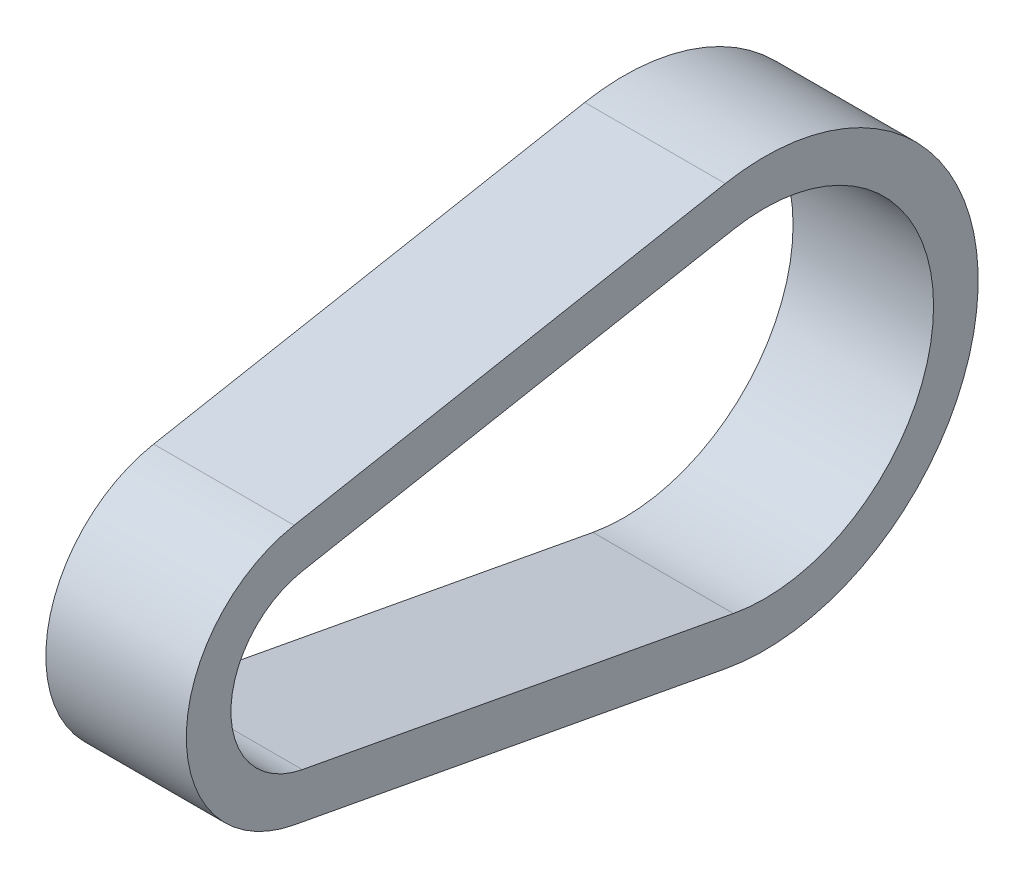
ISO-10303-21;
HEADER;
FILE_DESCRIPTION(('STEP AP214'),'2;1');
FILE_NAME('part.step','',(''),(''),'','','');
FILE_SCHEMA(('AUTOMOTIVE_DESIGN { 1 0 10303 214 1 1 1 1 }'));
ENDSEC;
DATA;
#1=APPLICATION_CONTEXT('core data for automotive mechanical design processes');
#2=APPLICATION_PROTOCOL_DEFINITION('international standard','automotive_design',2000,#1);
#3=PRODUCT_CONTEXT('',#1,'mechanical');
#4=PRODUCT('Part','Part','',(#3));
#5=PRODUCT_RELATED_PRODUCT_CATEGORY('part','',(#4));
#6=PRODUCT_DEFINITION_FORMATION('','',#4);
#7=PRODUCT_DEFINITION_CONTEXT('part definition',#1,'design');
#8=PRODUCT_DEFINITION('design','',#6,#7);
#9=PRODUCT_DEFINITION_SHAPE('','',#8);
#10=(LENGTH_UNIT() NAMED_UNIT(*) SI_UNIT(.MILLI.,.METRE.));
#11=(NAMED_UNIT(*) PLANE_ANGLE_UNIT() SI_UNIT($,.RADIAN.));
#12=(NAMED_UNIT(*) SI_UNIT($,.STERADIAN.) SOLID_ANGLE_UNIT());
#13=UNCERTAINTY_MEASURE_WITH_UNIT(LENGTH_MEASURE(1.E-05),#10,'distance_accuracy_value','');
#14=(GEOMETRIC_REPRESENTATION_CONTEXT(3) GLOBAL_UNCERTAINTY_ASSIGNED_CONTEXT((#13)) GLOBAL_UNIT_ASSIGNED_CONTEXT((#10,
#11,#12)) REPRESENTATION_CONTEXT('',''));
#15=CARTESIAN_POINT('',(0.,0.,0.));
#16=DIRECTION('',(0.,0.,1.));
#17=DIRECTION('',(1.,0.,0.));
#18=AXIS2_PLACEMENT_3D('',#15,#16,#17);
#19=CARTESIAN_POINT('',(7.5,0.,0.));
#20=DIRECTION('',(1.,0.,0.));
#21=DIRECTION('',(0.,0.,-1.));
#22=AXIS2_PLACEMENT_3D('',#19,#20,#21);
#23=PLANE('',#22);
#24=CARTESIAN_POINT('',(7.5,0.,0.));
#25=DIRECTION('',(1.,0.,0.));
#26=DIRECTION('',(0.,0.,-1.));
#27=AXIS2_PLACEMENT_3D('',#24,#25,#26);
#28=CIRCLE('',#27,14.09446);
#29=CARTESIAN_POINT('',(7.5,13.8557805108018,2.58285677653333));
#30=VERTEX_POINT('',#29);
#31=CARTESIAN_POINT('',(7.5,-13.8557805108018,2.58285677653333));
#32=VERTEX_POINT('',#31);
#33=EDGE_CURVE('E135',#30,#32,#28,.T.);
#34=ORIENTED_EDGE('',*,*,#33,.T.);
#35=DIRECTION('',(0.,-0.183253333333333,-0.983065723043084));
#36=VECTOR('',#35,1.);
#37=CARTESIAN_POINT('',(7.5,-13.8557805108018,2.58285677653333));
#38=LINE('',#37,#36);
#39=CARTESIAN_POINT('',(7.5,-22.435427624717,-43.442810752));
#40=VERTEX_POINT('',#39);
#41=EDGE_CURVE('E138',#32,#40,#38,.T.);
#42=ORIENTED_EDGE('',*,*,#41,.T.);
#43=CARTESIAN_POINT('',(7.5,0.,-47.625));
#44=DIRECTION('',(1.,0.,0.));
#45=DIRECTION('',(0.,0.,-1.));
#46=AXIS2_PLACEMENT_3D('',#43,#44,#45);
#47=CIRCLE('',#46,22.8219);
#48=CARTESIAN_POINT('',(7.5,22.435427624717,-43.442810752));
#49=VERTEX_POINT('',#48);
#50=EDGE_CURVE('E141',#40,#49,#47,.T.);
#51=ORIENTED_EDGE('',*,*,#50,.T.);
#52=DIRECTION('',(0.,-0.183253333333333,0.983065723043084));
#53=VECTOR('',#52,1.);
#54=CARTESIAN_POINT('',(7.5,13.8557805108018,2.58285677653333));
#55=LINE('',#54,#53);
#56=EDGE_CURVE('E143',#49,#30,#55,.T.);
#57=ORIENTED_EDGE('',*,*,#56,.T.);
#58=EDGE_LOOP('',(#34,#42,#51,#57));
#59=FACE_BOUND('',#58,.T.);
#60=DIRECTION('',(0.,-0.183253333333333,-0.983065723043084));
#61=VECTOR('',#60,1.);
#62=CARTESIAN_POINT('',(7.5,-9.17393000480914,1.71011277653333));
#63=LINE('',#62,#61);
#64=CARTESIAN_POINT('',(7.5,-9.17393000480914,1.71011277653333));
#65=VERTEX_POINT('',#64);
#66=CARTESIAN_POINT('',(7.5,-17.7535771187243,-44.315554752));
#67=VERTEX_POINT('',#66);
#68=EDGE_CURVE('E107',#65,#67,#63,.T.);
#69=ORIENTED_EDGE('',*,*,#68,.F.);
#70=CARTESIAN_POINT('',(7.5,0.,0.));
#71=DIRECTION('',(1.,0.,0.));
#72=DIRECTION('',(0.,0.,-1.));
#73=AXIS2_PLACEMENT_3D('',#70,#71,#72);
#74=CIRCLE('',#73,9.33196);
#75=CARTESIAN_POINT('',(7.5,9.17393000480914,1.71011277653333));
#76=VERTEX_POINT('',#75);
#77=EDGE_CURVE('E99',#76,#65,#74,.T.);
#78=ORIENTED_EDGE('',*,*,#77,.F.);
#79=DIRECTION('',(0.,-0.183253333333333,0.983065723043084));
#80=VECTOR('',#79,1.);
#81=CARTESIAN_POINT('',(7.5,9.17393000480914,1.71011277653333));
#82=LINE('',#81,#80);
#83=CARTESIAN_POINT('',(7.5,17.7535771187243,-44.315554752));
#84=VERTEX_POINT('',#83);
#85=EDGE_CURVE('E121',#84,#76,#82,.T.);
#86=ORIENTED_EDGE('',*,*,#85,.F.);
#87=CARTESIAN_POINT('',(7.5,0.,-47.625));
#88=DIRECTION('',(1.,0.,0.));
#89=DIRECTION('',(0.,0.,-1.));
#90=AXIS2_PLACEMENT_3D('',#87,#88,#89);
#91=CIRCLE('',#90,18.0594);
#92=EDGE_CURVE('E119',#67,#84,#91,.T.);
#93=ORIENTED_EDGE('',*,*,#92,.F.);
#94=EDGE_LOOP('',(#69,#78,#86,#93));
#95=FACE_BOUND('',#94,.T.);
#96=ADVANCED_FACE('F34',(#59,#95),#23,.T.);
#97=CARTESIAN_POINT('',(-7.5,0.,0.));
#98=DIRECTION('',(1.,0.,0.));
#99=DIRECTION('',(0.,0.,-1.));
#100=AXIS2_PLACEMENT_3D('',#97,#98,#99);
#101=PLANE('',#100);
#102=CARTESIAN_POINT('',(-7.5,0.,0.));
#103=DIRECTION('',(1.,0.,0.));
#104=DIRECTION('',(0.,0.,-1.));
#105=AXIS2_PLACEMENT_3D('',#102,#103,#104);
#106=CIRCLE('',#105,14.09446);
#107=CARTESIAN_POINT('',(-7.5,13.8557805108018,2.58285677653333));
#108=VERTEX_POINT('',#107);
#109=CARTESIAN_POINT('',(-7.5,-13.8557805108018,2.58285677653333));
#110=VERTEX_POINT('',#109);
#111=EDGE_CURVE('E115',#108,#110,#106,.T.);
#112=ORIENTED_EDGE('',*,*,#111,.F.);
#113=DIRECTION('',(0.,-0.183253333333333,0.983065723043084));
#114=VECTOR('',#113,1.);
#115=CARTESIAN_POINT('',(-7.5,13.8557805108018,2.58285677653333));
#116=LINE('',#115,#114);
#117=CARTESIAN_POINT('',(-7.5,22.435427624717,-43.442810752));
#118=VERTEX_POINT('',#117);
#119=EDGE_CURVE('E139',#118,#108,#116,.T.);
#120=ORIENTED_EDGE('',*,*,#119,.F.);
#121=CARTESIAN_POINT('',(-7.5,0.,-47.625));
#122=DIRECTION('',(1.,0.,0.));
#123=DIRECTION('',(0.,0.,-1.));
#124=AXIS2_PLACEMENT_3D('',#121,#122,#123);
#125=CIRCLE('',#124,22.8219);
#126=CARTESIAN_POINT('',(-7.5,-22.435427624717,-43.442810752));
#127=VERTEX_POINT('',#126);
#128=EDGE_CURVE('E150',#127,#118,#125,.T.);
#129=ORIENTED_EDGE('',*,*,#128,.F.);
#130=DIRECTION('',(0.,-0.183253333333333,-0.983065723043084));
#131=VECTOR('',#130,1.);
#132=CARTESIAN_POINT('',(-7.5,-13.8557805108018,2.58285677653333));
#133=LINE('',#132,#131);
#134=EDGE_CURVE('E148',#110,#127,#133,.T.);
#135=ORIENTED_EDGE('',*,*,#134,.F.);
#136=EDGE_LOOP('',(#112,#120,#129,#135));
#137=FACE_BOUND('',#136,.T.);
#138=CARTESIAN_POINT('',(-7.5,0.,0.));
#139=DIRECTION('',(1.,0.,0.));
#140=DIRECTION('',(0.,0.,-1.));
#141=AXIS2_PLACEMENT_3D('',#138,#139,#140);
#142=CIRCLE('',#141,9.33196);
#143=CARTESIAN_POINT('',(-7.5,9.17393000480914,1.71011277653333));
#144=VERTEX_POINT('',#143);
#145=CARTESIAN_POINT('',(-7.5,-9.17393000480914,1.71011277653333));
#146=VERTEX_POINT('',#145);
#147=EDGE_CURVE('E57',#144,#146,#142,.T.);
#148=ORIENTED_EDGE('',*,*,#147,.T.);
#149=DIRECTION('',(0.,-0.183253333333333,-0.983065723043084));
#150=VECTOR('',#149,1.);
#151=CARTESIAN_POINT('',(-7.5,-9.17393000480914,1.71011277653333));
#152=LINE('',#151,#150);
#153=CARTESIAN_POINT('',(-7.5,-17.7535771187243,-44.315554752));
#154=VERTEX_POINT('',#153);
#155=EDGE_CURVE('E114',#146,#154,#152,.T.);
#156=ORIENTED_EDGE('',*,*,#155,.T.);
#157=CARTESIAN_POINT('',(-7.5,0.,-47.625));
#158=DIRECTION('',(1.,0.,0.));
#159=DIRECTION('',(0.,0.,-1.));
#160=AXIS2_PLACEMENT_3D('',#157,#158,#159);
#161=CIRCLE('',#160,18.0594);
#162=CARTESIAN_POINT('',(-7.5,17.7535771187243,-44.315554752));
#163=VERTEX_POINT('',#162);
#164=EDGE_CURVE('E127',#154,#163,#161,.T.);
#165=ORIENTED_EDGE('',*,*,#164,.T.);
#166=DIRECTION('',(0.,-0.183253333333333,0.983065723043084));
#167=VECTOR('',#166,1.);
#168=CARTESIAN_POINT('',(-7.5,9.17393000480914,1.71011277653333));
#169=LINE('',#168,#167);
#170=EDGE_CURVE('E108',#163,#144,#169,.T.);
#171=ORIENTED_EDGE('',*,*,#170,.T.);
#172=EDGE_LOOP('',(#148,#156,#165,#171));
#173=FACE_BOUND('',#172,.T.);
#174=ADVANCED_FACE('F168',(#137,#173),#101,.F.);
#175=CARTESIAN_POINT('',(7.5,0.,0.));
#176=DIRECTION('',(-1.,0.,0.));
#177=DIRECTION('',(0.,0.,1.));
#178=AXIS2_PLACEMENT_3D('',#175,#176,#177);
#179=CYLINDRICAL_SURFACE('',#178,14.09446);
#180=ORIENTED_EDGE('',*,*,#111,.T.);
#181=DIRECTION('',(-1.,0.,0.));
#182=VECTOR('',#181,1.);
#183=CARTESIAN_POINT('',(7.5,-13.8557805108018,2.58285677653333));
#184=LINE('',#183,#182);
#185=EDGE_CURVE('E11',#32,#110,#184,.T.);
#186=ORIENTED_EDGE('',*,*,#185,.F.);
#187=ORIENTED_EDGE('',*,*,#33,.F.);
#188=DIRECTION('',(-1.,0.,0.));
#189=VECTOR('',#188,1.);
#190=CARTESIAN_POINT('',(7.5,13.8557805108018,2.58285677653333));
#191=LINE('',#190,#189);
#192=EDGE_CURVE('E145',#30,#108,#191,.T.);
#193=ORIENTED_EDGE('',*,*,#192,.T.);
#194=EDGE_LOOP('',(#180,#186,#187,#193));
#195=FACE_BOUND('',#194,.T.);
#196=ADVANCED_FACE('F36',(#195),#179,.T.);
#197=CARTESIAN_POINT('',(7.5,-13.8557805108018,2.58285677653333));
#198=DIRECTION('',(0.,0.983065723043084,-0.183253333333333));
#199=DIRECTION('',(0.,0.183253333333333,0.983065723043084));
#200=AXIS2_PLACEMENT_3D('',#197,#198,#199);
#201=PLANE('',#200);
#202=ORIENTED_EDGE('',*,*,#134,.T.);
#203=DIRECTION('',(-1.,0.,0.));
#204=VECTOR('',#203,1.);
#205=CARTESIAN_POINT('',(7.5,-22.435427624717,-43.442810752));
#206=LINE('',#205,#204);
#207=EDGE_CURVE('E42',#40,#127,#206,.T.);
#208=ORIENTED_EDGE('',*,*,#207,.F.);
#209=ORIENTED_EDGE('',*,*,#41,.F.);
#210=ORIENTED_EDGE('',*,*,#185,.T.);
#211=EDGE_LOOP('',(#202,#208,#209,#210));
#212=FACE_BOUND('',#211,.T.);
#213=ADVANCED_FACE('F178',(#212),#201,.F.);
#214=CARTESIAN_POINT('',(7.5,0.,-47.625));
#215=DIRECTION('',(-1.,0.,0.));
#216=DIRECTION('',(0.,0.,1.));
#217=AXIS2_PLACEMENT_3D('',#214,#215,#216);
#218=CYLINDRICAL_SURFACE('',#217,22.8219);
#219=ORIENTED_EDGE('',*,*,#128,.T.);
#220=DIRECTION('',(-1.,0.,0.));
#221=VECTOR('',#220,1.);
#222=CARTESIAN_POINT('',(7.5,22.435427624717,-43.442810752));
#223=LINE('',#222,#221);
#224=EDGE_CURVE('E155',#49,#118,#223,.T.);
#225=ORIENTED_EDGE('',*,*,#224,.F.);
#226=ORIENTED_EDGE('',*,*,#50,.F.);
#227=ORIENTED_EDGE('',*,*,#207,.T.);
#228=EDGE_LOOP('',(#219,#225,#226,#227));
#229=FACE_BOUND('',#228,.T.);
#230=ADVANCED_FACE('F162',(#229),#218,.T.);
#231=CARTESIAN_POINT('',(7.5,13.8557805108018,2.58285677653333));
#232=DIRECTION('',(0.,-0.983065723043084,-0.183253333333333));
#233=DIRECTION('',(0.,0.183253333333333,-0.983065723043084));
#234=AXIS2_PLACEMENT_3D('',#231,#232,#233);
#235=PLANE('',#234);
#236=ORIENTED_EDGE('',*,*,#119,.T.);
#237=ORIENTED_EDGE('',*,*,#192,.F.);
#238=ORIENTED_EDGE('',*,*,#56,.F.);
#239=ORIENTED_EDGE('',*,*,#224,.T.);
#240=EDGE_LOOP('',(#236,#237,#238,#239));
#241=FACE_BOUND('',#240,.T.);
#242=ADVANCED_FACE('F172',(#241),#235,.F.);
#243=CARTESIAN_POINT('',(7.5,0.,0.));
#244=DIRECTION('',(-1.,0.,0.));
#245=DIRECTION('',(0.,0.,1.));
#246=AXIS2_PLACEMENT_3D('',#243,#244,#245);
#247=CYLINDRICAL_SURFACE('',#246,9.33196);
#248=ORIENTED_EDGE('',*,*,#147,.F.);
#249=DIRECTION('',(-1.,0.,0.));
#250=VECTOR('',#249,1.);
#251=CARTESIAN_POINT('',(7.5,9.17393000480914,1.71011277653333));
#252=LINE('',#251,#250);
#253=EDGE_CURVE('E103',#76,#144,#252,.T.);
#254=ORIENTED_EDGE('',*,*,#253,.F.);
#255=ORIENTED_EDGE('',*,*,#77,.T.);
#256=DIRECTION('',(-1.,0.,0.));
#257=VECTOR('',#256,1.);
#258=CARTESIAN_POINT('',(7.5,-9.17393000480914,1.71011277653333));
#259=LINE('',#258,#257);
#260=EDGE_CURVE('E102',#65,#146,#259,.T.);
#261=ORIENTED_EDGE('',*,*,#260,.T.);
#262=EDGE_LOOP('',(#248,#254,#255,#261));
#263=FACE_BOUND('',#262,.T.);
#264=ADVANCED_FACE('F101',(#263),#247,.F.);
#265=CARTESIAN_POINT('',(7.5,-9.17393000480914,1.71011277653333));
#266=DIRECTION('',(0.,0.983065723043084,-0.183253333333333));
#267=DIRECTION('',(0.,0.183253333333333,0.983065723043084));
#268=AXIS2_PLACEMENT_3D('',#265,#266,#267);
#269=PLANE('',#268);
#270=ORIENTED_EDGE('',*,*,#155,.F.);
#271=ORIENTED_EDGE('',*,*,#260,.F.);
#272=ORIENTED_EDGE('',*,*,#68,.T.);
#273=DIRECTION('',(-1.,0.,0.));
#274=VECTOR('',#273,1.);
#275=CARTESIAN_POINT('',(7.5,-17.7535771187243,-44.315554752));
#276=LINE('',#275,#274);
#277=EDGE_CURVE('E116',#67,#154,#276,.T.);
#278=ORIENTED_EDGE('',*,*,#277,.T.);
#279=EDGE_LOOP('',(#270,#271,#272,#278));
#280=FACE_BOUND('',#279,.T.);
#281=ADVANCED_FACE('F111',(#280),#269,.T.);
#282=CARTESIAN_POINT('',(7.5,0.,-47.625));
#283=DIRECTION('',(-1.,0.,0.));
#284=DIRECTION('',(0.,0.,1.));
#285=AXIS2_PLACEMENT_3D('',#282,#283,#284);
#286=CYLINDRICAL_SURFACE('',#285,18.0594);
#287=ORIENTED_EDGE('',*,*,#164,.F.);
#288=ORIENTED_EDGE('',*,*,#277,.F.);
#289=ORIENTED_EDGE('',*,*,#92,.T.);
#290=DIRECTION('',(-1.,0.,0.));
#291=VECTOR('',#290,1.);
#292=CARTESIAN_POINT('',(7.5,17.7535771187243,-44.315554752));
#293=LINE('',#292,#291);
#294=EDGE_CURVE('E49',#84,#163,#293,.T.);
#295=ORIENTED_EDGE('',*,*,#294,.T.);
#296=EDGE_LOOP('',(#287,#288,#289,#295));
#297=FACE_BOUND('',#296,.T.);
#298=ADVANCED_FACE('F201',(#297),#286,.F.);
#299=CARTESIAN_POINT('',(7.5,9.17393000480914,1.71011277653333));
#300=DIRECTION('',(0.,-0.983065723043084,-0.183253333333333));
#301=DIRECTION('',(0.,0.183253333333333,-0.983065723043084));
#302=AXIS2_PLACEMENT_3D('',#299,#300,#301);
#303=PLANE('',#302);
#304=ORIENTED_EDGE('',*,*,#170,.F.);
#305=ORIENTED_EDGE('',*,*,#294,.F.);
#306=ORIENTED_EDGE('',*,*,#85,.T.);
#307=ORIENTED_EDGE('',*,*,#253,.T.);
#308=EDGE_LOOP('',(#304,#305,#306,#307));
#309=FACE_BOUND('',#308,.T.);
#310=ADVANCED_FACE('F205',(#309),#303,.T.);
#311=CLOSED_SHELL('',(#96,#174,#196,#213,#230,#242,#264,#281,#298,#310));
#312=MANIFOLD_SOLID_BREP('B2',#311);
#313=ADVANCED_BREP_SHAPE_REPRESENTATION('',(#18,#312),#14);
#314=SHAPE_DEFINITION_REPRESENTATION(#9,#313);
ENDSEC;
END-ISO-10303-21;
